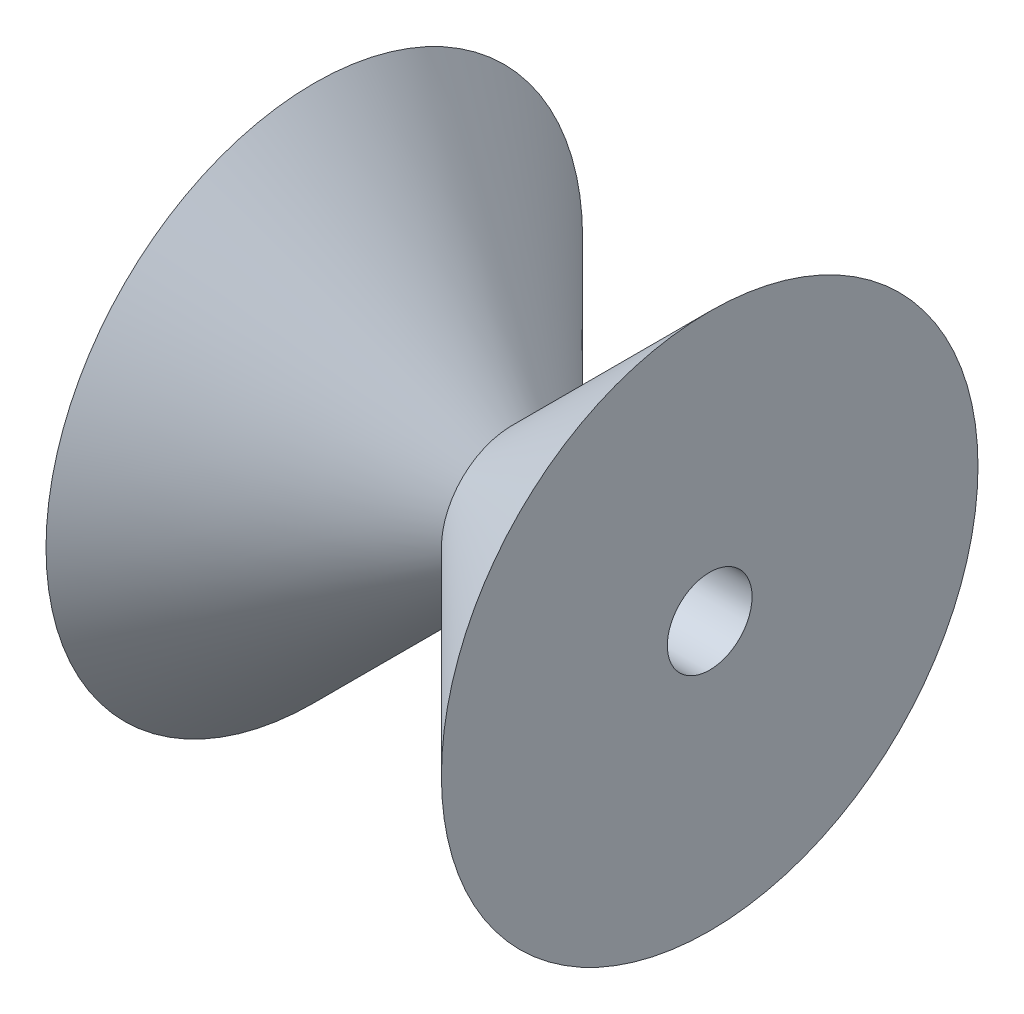
ISO-10303-21;
HEADER;
FILE_DESCRIPTION(('STEP AP214'),'2;1');
FILE_NAME('part.step','',(''),(''),'','','');
FILE_SCHEMA(('AUTOMOTIVE_DESIGN { 1 0 10303 214 1 1 1 1 }'));
ENDSEC;
DATA;
#1=APPLICATION_CONTEXT('core data for automotive mechanical design processes');
#2=APPLICATION_PROTOCOL_DEFINITION('international standard','automotive_design',2000,#1);
#3=PRODUCT_CONTEXT('',#1,'mechanical');
#4=PRODUCT('Part','Part','',(#3));
#5=PRODUCT_RELATED_PRODUCT_CATEGORY('part','',(#4));
#6=PRODUCT_DEFINITION_FORMATION('','',#4);
#7=PRODUCT_DEFINITION_CONTEXT('part definition',#1,'design');
#8=PRODUCT_DEFINITION('design','',#6,#7);
#9=PRODUCT_DEFINITION_SHAPE('','',#8);
#10=(LENGTH_UNIT() NAMED_UNIT(*) SI_UNIT(.MILLI.,.METRE.));
#11=(NAMED_UNIT(*) PLANE_ANGLE_UNIT() SI_UNIT($,.RADIAN.));
#12=(NAMED_UNIT(*) SI_UNIT($,.STERADIAN.) SOLID_ANGLE_UNIT());
#13=UNCERTAINTY_MEASURE_WITH_UNIT(LENGTH_MEASURE(1.E-05),#10,'distance_accuracy_value','');
#14=(GEOMETRIC_REPRESENTATION_CONTEXT(3) GLOBAL_UNCERTAINTY_ASSIGNED_CONTEXT((#13)) GLOBAL_UNIT_ASSIGNED_CONTEXT((#10,
#11,#12)) REPRESENTATION_CONTEXT('',''));
#15=CARTESIAN_POINT('',(0.,0.,0.));
#16=DIRECTION('',(0.,0.,1.));
#17=DIRECTION('',(1.,0.,0.));
#18=AXIS2_PLACEMENT_3D('',#15,#16,#17);
#19=CARTESIAN_POINT('',(0.,0.,0.));
#20=DIRECTION('',(1.,0.,0.));
#21=DIRECTION('',(0.,0.,-1.));
#22=AXIS2_PLACEMENT_3D('',#19,#20,#21);
#23=CONICAL_SURFACE('',#22,12.5,0.78539816339745);
#24=CARTESIAN_POINT('',(35.,0.,0.));
#25=DIRECTION('',(1.,0.,0.));
#26=DIRECTION('',(0.,0.,-1.));
#27=AXIS2_PLACEMENT_3D('',#24,#25,#26);
#28=CIRCLE('',#27,47.5000000000001);
#29=CARTESIAN_POINT('',(35.,0.,-47.5000000000001));
#30=VERTEX_POINT('',#29);
#31=EDGE_CURVE('E10',#30,#30,#28,.T.);
#32=ORIENTED_EDGE('',*,*,#31,.F.);
#33=EDGE_LOOP('',(#32));
#34=FACE_BOUND('',#33,.T.);
#35=CARTESIAN_POINT('',(0.,0.,0.));
#36=DIRECTION('',(1.,0.,0.));
#37=DIRECTION('',(0.,0.,-1.));
#38=AXIS2_PLACEMENT_3D('',#35,#36,#37);
#39=CIRCLE('',#38,12.5);
#40=CARTESIAN_POINT('',(0.,0.,-12.5));
#41=VERTEX_POINT('',#40);
#42=EDGE_CURVE('E47',#41,#41,#39,.T.);
#43=ORIENTED_EDGE('',*,*,#42,.T.);
#44=EDGE_LOOP('',(#43));
#45=FACE_BOUND('',#44,.T.);
#46=ADVANCED_FACE('F37',(#34,#45),#23,.T.);
#47=CARTESIAN_POINT('',(35.,0.,0.));
#48=DIRECTION('',(1.,0.,0.));
#49=DIRECTION('',(0.,0.,-1.));
#50=AXIS2_PLACEMENT_3D('',#47,#48,#49);
#51=PLANE('',#50);
#52=CARTESIAN_POINT('',(35.,0.,0.));
#53=DIRECTION('',(1.,0.,0.));
#54=DIRECTION('',(0.,0.,-1.));
#55=AXIS2_PLACEMENT_3D('',#52,#53,#54);
#56=CIRCLE('',#55,7.5);
#57=CARTESIAN_POINT('',(35.,0.,-7.5));
#58=VERTEX_POINT('',#57);
#59=EDGE_CURVE('E54',#58,#58,#56,.T.);
#60=ORIENTED_EDGE('',*,*,#59,.F.);
#61=EDGE_LOOP('',(#60));
#62=FACE_BOUND('',#61,.T.);
#63=ORIENTED_EDGE('',*,*,#31,.T.);
#64=EDGE_LOOP('',(#63));
#65=FACE_BOUND('',#64,.T.);
#66=ADVANCED_FACE('F69',(#62,#65),#51,.T.);
#67=CARTESIAN_POINT('',(0.,0.,0.));
#68=DIRECTION('',(-1.,0.,0.));
#69=DIRECTION('',(0.,0.,-1.));
#70=AXIS2_PLACEMENT_3D('',#67,#68,#69);
#71=CONICAL_SURFACE('',#70,12.5,0.78539816339745);
#72=CARTESIAN_POINT('',(-35.,0.,0.));
#73=DIRECTION('',(-1.,0.,0.));
#74=DIRECTION('',(0.,0.,1.));
#75=AXIS2_PLACEMENT_3D('',#72,#73,#74);
#76=CIRCLE('',#75,47.5000000000001);
#77=CARTESIAN_POINT('',(-35.,0.,47.5000000000001));
#78=VERTEX_POINT('',#77);
#79=EDGE_CURVE('E43',#78,#78,#76,.F.);
#80=ORIENTED_EDGE('',*,*,#79,.T.);
#81=EDGE_LOOP('',(#80));
#82=FACE_BOUND('',#81,.T.);
#83=ORIENTED_EDGE('',*,*,#42,.F.);
#84=EDGE_LOOP('',(#83));
#85=FACE_BOUND('',#84,.T.);
#86=ADVANCED_FACE('F71',(#82,#85),#71,.T.);
#87=CARTESIAN_POINT('',(-35.,0.,0.));
#88=DIRECTION('',(-1.,0.,0.));
#89=DIRECTION('',(0.,0.,-1.));
#90=AXIS2_PLACEMENT_3D('',#87,#88,#89);
#91=PLANE('',#90);
#92=CARTESIAN_POINT('',(-35.,0.,0.));
#93=DIRECTION('',(1.,0.,0.));
#94=DIRECTION('',(0.,0.,-1.));
#95=AXIS2_PLACEMENT_3D('',#92,#93,#94);
#96=CIRCLE('',#95,7.5);
#97=CARTESIAN_POINT('',(-35.,0.,-7.5));
#98=VERTEX_POINT('',#97);
#99=EDGE_CURVE('E51',#98,#98,#96,.T.);
#100=ORIENTED_EDGE('',*,*,#99,.T.);
#101=EDGE_LOOP('',(#100));
#102=FACE_BOUND('',#101,.T.);
#103=ORIENTED_EDGE('',*,*,#79,.F.);
#104=EDGE_LOOP('',(#103));
#105=FACE_BOUND('',#104,.T.);
#106=ADVANCED_FACE('F60',(#102,#105),#91,.T.);
#107=CARTESIAN_POINT('',(-35.,0.,0.));
#108=DIRECTION('',(1.,0.,0.));
#109=DIRECTION('',(0.,0.,-1.));
#110=AXIS2_PLACEMENT_3D('',#107,#108,#109);
#111=CYLINDRICAL_SURFACE('',#110,7.5);
#112=ORIENTED_EDGE('',*,*,#99,.F.);
#113=EDGE_LOOP('',(#112));
#114=FACE_BOUND('',#113,.T.);
#115=ORIENTED_EDGE('',*,*,#59,.T.);
#116=EDGE_LOOP('',(#115));
#117=FACE_BOUND('',#116,.T.);
#118=ADVANCED_FACE('F63',(#114,#117),#111,.F.);
#119=CLOSED_SHELL('',(#46,#66,#86,#106,#118));
#120=MANIFOLD_SOLID_BREP('B2',#119);
#121=ADVANCED_BREP_SHAPE_REPRESENTATION('',(#18,#120),#14);
#122=SHAPE_DEFINITION_REPRESENTATION(#9,#121);
ENDSEC;
END-ISO-10303-21;
